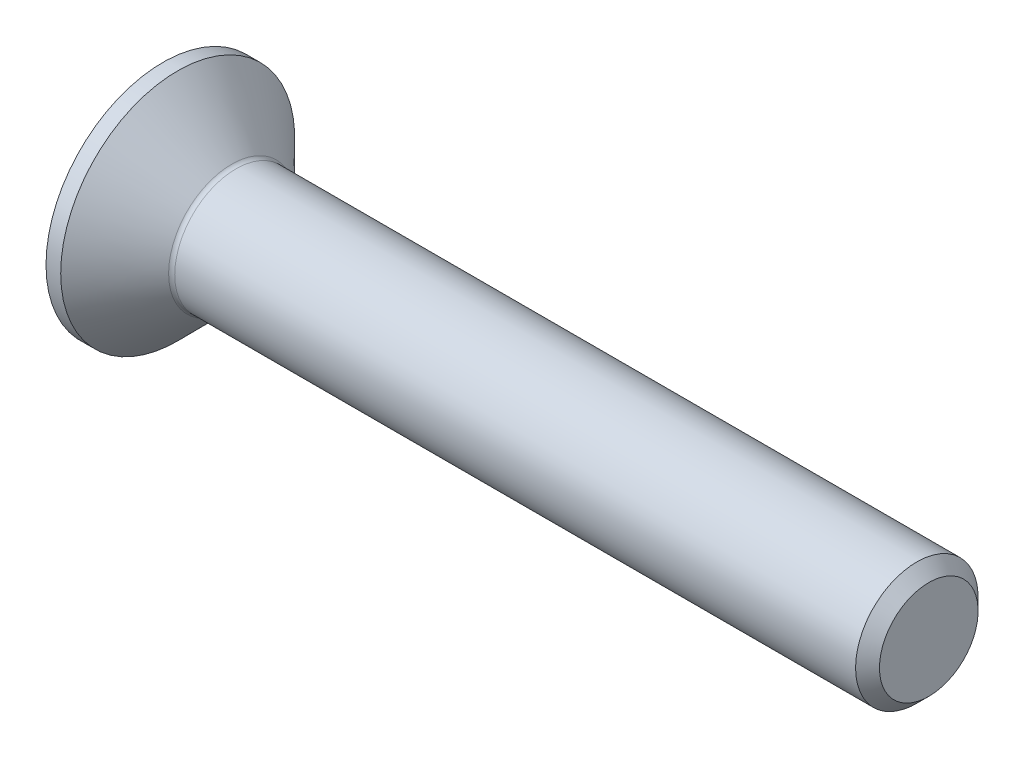
ISO-10303-21;
HEADER;
FILE_DESCRIPTION(('STEP AP214'),'2;1');
FILE_NAME('part.step','',(''),(''),'','','');
FILE_SCHEMA(('AUTOMOTIVE_DESIGN { 1 0 10303 214 1 1 1 1 }'));
ENDSEC;
DATA;
#1=APPLICATION_CONTEXT('core data for automotive mechanical design processes');
#2=APPLICATION_PROTOCOL_DEFINITION('international standard','automotive_design',2000,#1);
#3=PRODUCT_CONTEXT('',#1,'mechanical');
#4=PRODUCT('Part','Part','',(#3));
#5=PRODUCT_RELATED_PRODUCT_CATEGORY('part','',(#4));
#6=PRODUCT_DEFINITION_FORMATION('','',#4);
#7=PRODUCT_DEFINITION_CONTEXT('part definition',#1,'design');
#8=PRODUCT_DEFINITION('design','',#6,#7);
#9=PRODUCT_DEFINITION_SHAPE('','',#8);
#10=(LENGTH_UNIT() NAMED_UNIT(*) SI_UNIT(.MILLI.,.METRE.));
#11=(NAMED_UNIT(*) PLANE_ANGLE_UNIT() SI_UNIT($,.RADIAN.));
#12=(NAMED_UNIT(*) SI_UNIT($,.STERADIAN.) SOLID_ANGLE_UNIT());
#13=UNCERTAINTY_MEASURE_WITH_UNIT(LENGTH_MEASURE(1.E-05),#10,'distance_accuracy_value','');
#14=(GEOMETRIC_REPRESENTATION_CONTEXT(3) GLOBAL_UNCERTAINTY_ASSIGNED_CONTEXT((#13)) GLOBAL_UNIT_ASSIGNED_CONTEXT((#10,
#11,#12)) REPRESENTATION_CONTEXT('',''));
#15=CARTESIAN_POINT('',(0.,0.,0.));
#16=DIRECTION('',(0.,0.,1.));
#17=DIRECTION('',(1.,0.,0.));
#18=AXIS2_PLACEMENT_3D('',#15,#16,#17);
#19=CARTESIAN_POINT('',(0.,0.,0.));
#20=DIRECTION('',(-1.,0.,0.));
#21=DIRECTION('',(0.,0.,1.));
#22=AXIS2_PLACEMENT_3D('',#19,#20,#21);
#23=PLANE('',#22);
#24=CARTESIAN_POINT('',(0.,0.,0.));
#25=DIRECTION('',(-1.,0.,0.));
#26=DIRECTION('',(0.,0.,1.));
#27=AXIS2_PLACEMENT_3D('',#24,#25,#26);
#28=CIRCLE('',#27,3.82);
#29=CARTESIAN_POINT('',(0.,0.,3.82));
#30=VERTEX_POINT('',#29);
#31=EDGE_CURVE('E157',#30,#30,#28,.T.);
#32=ORIENTED_EDGE('',*,*,#31,.T.);
#33=EDGE_LOOP('',(#32));
#34=FACE_BOUND('',#33,.T.);
#35=DIRECTION('',(0.,-0.5,-0.866025403784439));
#36=VECTOR('',#35,1.);
#37=CARTESIAN_POINT('',(0.,-0.727461339178927,1.26));
#38=LINE('',#37,#36);
#39=CARTESIAN_POINT('',(0.,-0.727461339178927,1.26));
#40=VERTEX_POINT('',#39);
#41=CARTESIAN_POINT('',(0.,-1.45492267835786,0.));
#42=VERTEX_POINT('',#41);
#43=EDGE_CURVE('E119',#40,#42,#38,.T.);
#44=ORIENTED_EDGE('',*,*,#43,.T.);
#45=DIRECTION('',(0.,0.5,-0.866025403784439));
#46=VECTOR('',#45,1.);
#47=CARTESIAN_POINT('',(0.,-1.45492267835786,0.));
#48=LINE('',#47,#46);
#49=CARTESIAN_POINT('',(0.,-0.727461339178928,-1.26));
#50=VERTEX_POINT('',#49);
#51=EDGE_CURVE('E49',#42,#50,#48,.T.);
#52=ORIENTED_EDGE('',*,*,#51,.T.);
#53=DIRECTION('',(0.,1.,0.));
#54=VECTOR('',#53,1.);
#55=CARTESIAN_POINT('',(0.,-0.727461339178928,-1.26));
#56=LINE('',#55,#54);
#57=CARTESIAN_POINT('',(0.,0.72746133917893,-1.26));
#58=VERTEX_POINT('',#57);
#59=EDGE_CURVE('E134',#50,#58,#56,.T.);
#60=ORIENTED_EDGE('',*,*,#59,.T.);
#61=DIRECTION('',(0.,0.5,0.866025403784439));
#62=VECTOR('',#61,1.);
#63=CARTESIAN_POINT('',(0.,0.72746133917893,-1.26));
#64=LINE('',#63,#62);
#65=CARTESIAN_POINT('',(0.,1.45492267835786,0.));
#66=VERTEX_POINT('',#65);
#67=EDGE_CURVE('E270',#58,#66,#64,.T.);
#68=ORIENTED_EDGE('',*,*,#67,.T.);
#69=DIRECTION('',(0.,-0.5,0.866025403784439));
#70=VECTOR('',#69,1.);
#71=CARTESIAN_POINT('',(0.,1.45492267835786,0.));
#72=LINE('',#71,#70);
#73=CARTESIAN_POINT('',(0.,0.72746133917893,1.26));
#74=VERTEX_POINT('',#73);
#75=EDGE_CURVE('E273',#66,#74,#72,.T.);
#76=ORIENTED_EDGE('',*,*,#75,.T.);
#77=DIRECTION('',(0.,-1.,0.));
#78=VECTOR('',#77,1.);
#79=CARTESIAN_POINT('',(0.,0.72746133917893,1.26));
#80=LINE('',#79,#78);
#81=EDGE_CURVE('E276',#74,#40,#80,.T.);
#82=ORIENTED_EDGE('',*,*,#81,.T.);
#83=EDGE_LOOP('',(#44,#52,#60,#68,#76,#82));
#84=FACE_BOUND('',#83,.T.);
#85=ADVANCED_FACE('F34',(#34,#84),#23,.T.);
#86=CARTESIAN_POINT('',(0.,0.,0.));
#87=DIRECTION('',(-1.,0.,0.));
#88=DIRECTION('',(0.,0.,1.));
#89=AXIS2_PLACEMENT_3D('',#86,#87,#88);
#90=CYLINDRICAL_SURFACE('',#89,3.82);
#91=CARTESIAN_POINT('',(0.480000000000008,0.,0.));
#92=DIRECTION('',(-1.,0.,0.));
#93=DIRECTION('',(0.,0.,1.));
#94=AXIS2_PLACEMENT_3D('',#91,#92,#93);
#95=CIRCLE('',#94,3.82);
#96=CARTESIAN_POINT('',(0.480000000000008,0.,3.82));
#97=VERTEX_POINT('',#96);
#98=EDGE_CURVE('E154',#97,#97,#95,.T.);
#99=ORIENTED_EDGE('',*,*,#98,.T.);
#100=EDGE_LOOP('',(#99));
#101=FACE_BOUND('',#100,.T.);
#102=ORIENTED_EDGE('',*,*,#31,.F.);
#103=EDGE_LOOP('',(#102));
#104=FACE_BOUND('',#103,.T.);
#105=ADVANCED_FACE('F178',(#101,#104),#90,.T.);
#106=CARTESIAN_POINT('',(0.480000000000008,0.,0.));
#107=DIRECTION('',(-1.,0.,0.));
#108=DIRECTION('',(0.,0.,1.));
#109=AXIS2_PLACEMENT_3D('',#106,#107,#108);
#110=CONICAL_SURFACE('',#109,3.82,0.78539816339745);
#111=CARTESIAN_POINT('',(2.24142135623731,0.,0.));
#112=DIRECTION('',(-1.,0.,0.));
#113=DIRECTION('',(0.,0.,1.));
#114=AXIS2_PLACEMENT_3D('',#111,#112,#113);
#115=CIRCLE('',#114,2.05857864376269);
#116=CARTESIAN_POINT('',(2.24142135623731,0.,2.05857864376269));
#117=VERTEX_POINT('',#116);
#118=EDGE_CURVE('E42',#117,#117,#115,.T.);
#119=ORIENTED_EDGE('',*,*,#118,.T.);
#120=EDGE_LOOP('',(#119));
#121=FACE_BOUND('',#120,.T.);
#122=ORIENTED_EDGE('',*,*,#98,.F.);
#123=EDGE_LOOP('',(#122));
#124=FACE_BOUND('',#123,.T.);
#125=ADVANCED_FACE('F162',(#121,#124),#110,.T.);
#126=CARTESIAN_POINT('',(0.,0.,0.));
#127=DIRECTION('',(-1.,0.,0.));
#128=DIRECTION('',(0.,0.,1.));
#129=AXIS2_PLACEMENT_3D('',#126,#127,#128);
#130=CYLINDRICAL_SURFACE('',#129,2.);
#131=CARTESIAN_POINT('',(2.38284271247462,0.,0.));
#132=DIRECTION('',(-1.,0.,0.));
#133=DIRECTION('',(0.,0.,1.));
#134=AXIS2_PLACEMENT_3D('',#131,#132,#133);
#135=CIRCLE('',#134,2.);
#136=CARTESIAN_POINT('',(2.38284271247462,0.,2.));
#137=VERTEX_POINT('',#136);
#138=EDGE_CURVE('E11',#137,#137,#135,.F.);
#139=ORIENTED_EDGE('',*,*,#138,.T.);
#140=EDGE_LOOP('',(#139));
#141=FACE_BOUND('',#140,.T.);
#142=CARTESIAN_POINT('',(24.61,0.,0.));
#143=DIRECTION('',(-1.,0.,0.));
#144=DIRECTION('',(0.,0.,1.));
#145=AXIS2_PLACEMENT_3D('',#142,#143,#144);
#146=CIRCLE('',#145,2.);
#147=CARTESIAN_POINT('',(24.61,0.,2.));
#148=VERTEX_POINT('',#147);
#149=EDGE_CURVE('E151',#148,#148,#146,.T.);
#150=ORIENTED_EDGE('',*,*,#149,.T.);
#151=EDGE_LOOP('',(#150));
#152=FACE_BOUND('',#151,.T.);
#153=ADVANCED_FACE('F189',(#141,#152),#130,.T.);
#154=CARTESIAN_POINT('',(25.,0.,0.));
#155=DIRECTION('',(-1.,0.,0.));
#156=DIRECTION('',(0.,0.,1.));
#157=AXIS2_PLACEMENT_3D('',#154,#155,#156);
#158=CONICAL_SURFACE('',#157,1.61,0.78539816339747);
#159=ORIENTED_EDGE('',*,*,#149,.F.);
#160=EDGE_LOOP('',(#159));
#161=FACE_BOUND('',#160,.T.);
#162=CARTESIAN_POINT('',(25.,0.,0.));
#163=DIRECTION('',(-1.,0.,0.));
#164=DIRECTION('',(0.,0.,1.));
#165=AXIS2_PLACEMENT_3D('',#162,#163,#164);
#166=CIRCLE('',#165,1.61);
#167=CARTESIAN_POINT('',(25.,0.,1.61));
#168=VERTEX_POINT('',#167);
#169=EDGE_CURVE('E147',#168,#168,#166,.T.);
#170=ORIENTED_EDGE('',*,*,#169,.T.);
#171=EDGE_LOOP('',(#170));
#172=FACE_BOUND('',#171,.T.);
#173=ADVANCED_FACE('F173',(#161,#172),#158,.T.);
#174=CARTESIAN_POINT('',(25.,1.61,0.));
#175=DIRECTION('',(1.,0.,0.));
#176=DIRECTION('',(0.,0.,-1.));
#177=AXIS2_PLACEMENT_3D('',#174,#175,#176);
#178=PLANE('',#177);
#179=ORIENTED_EDGE('',*,*,#169,.F.);
#180=EDGE_LOOP('',(#179));
#181=FACE_BOUND('',#180,.T.);
#182=ADVANCED_FACE('F166',(#181),#178,.T.);
#183=CARTESIAN_POINT('',(2.38284271247462,0.,0.));
#184=DIRECTION('',(-1.,0.,0.));
#185=DIRECTION('',(0.,0.,1.));
#186=AXIS2_PLACEMENT_3D('',#183,#184,#185);
#187=TOROIDAL_SURFACE('',#186,2.2,0.2);
#188=ORIENTED_EDGE('',*,*,#138,.F.);
#189=EDGE_LOOP('',(#188));
#190=FACE_BOUND('',#189,.T.);
#191=ORIENTED_EDGE('',*,*,#118,.F.);
#192=EDGE_LOOP('',(#191));
#193=FACE_BOUND('',#192,.T.);
#194=ADVANCED_FACE('F36',(#190,#193),#187,.F.);
#195=CARTESIAN_POINT('',(1.8,-1.45492267835786,0.));
#196=DIRECTION('',(0.,0.866025403784439,0.5));
#197=DIRECTION('',(0.,-0.5,0.866025403784439));
#198=AXIS2_PLACEMENT_3D('',#195,#196,#197);
#199=PLANE('',#198);
#200=ORIENTED_EDGE('',*,*,#51,.F.);
#201=DIRECTION('',(-1.,0.,0.));
#202=VECTOR('',#201,1.);
#203=CARTESIAN_POINT('',(1.8,-1.45492267835786,0.));
#204=LINE('',#203,#202);
#205=CARTESIAN_POINT('',(1.8,-1.45492267835786,0.));
#206=VERTEX_POINT('',#205);
#207=EDGE_CURVE('E267',#206,#42,#204,.T.);
#208=ORIENTED_EDGE('',*,*,#207,.F.);
#209=DIRECTION('',(0.,0.5,-0.866025403784439));
#210=VECTOR('',#209,1.);
#211=CARTESIAN_POINT('',(1.8,-1.45492267835786,0.));
#212=LINE('',#211,#210);
#213=CARTESIAN_POINT('',(1.8,-1.09119200876839,-0.63));
#214=VERTEX_POINT('',#213);
#215=EDGE_CURVE('E116',#206,#214,#212,.T.);
#216=ORIENTED_EDGE('',*,*,#215,.T.);
#217=CARTESIAN_POINT('',(1.8,-0.727461339178928,-1.26));
#218=VERTEX_POINT('',#217);
#219=EDGE_CURVE('E110',#214,#218,#212,.T.);
#220=ORIENTED_EDGE('',*,*,#219,.T.);
#221=DIRECTION('',(-1.,0.,0.));
#222=VECTOR('',#221,1.);
#223=CARTESIAN_POINT('',(1.8,-0.727461339178928,-1.26));
#224=LINE('',#223,#222);
#225=EDGE_CURVE('E114',#218,#50,#224,.T.);
#226=ORIENTED_EDGE('',*,*,#225,.T.);
#227=EDGE_LOOP('',(#200,#208,#216,#220,#226));
#228=FACE_BOUND('',#227,.T.);
#229=ADVANCED_FACE('F112',(#228),#199,.T.);
#230=CARTESIAN_POINT('',(1.8,-0.727461339178928,-1.26));
#231=DIRECTION('',(0.,0.,1.));
#232=DIRECTION('',(0.,-1.,0.));
#233=AXIS2_PLACEMENT_3D('',#230,#231,#232);
#234=PLANE('',#233);
#235=ORIENTED_EDGE('',*,*,#59,.F.);
#236=ORIENTED_EDGE('',*,*,#225,.F.);
#237=DIRECTION('',(0.,1.,0.));
#238=VECTOR('',#237,1.);
#239=CARTESIAN_POINT('',(1.8,-0.727461339178928,-1.26));
#240=LINE('',#239,#238);
#241=CARTESIAN_POINT('',(1.8,0.,-1.26));
#242=VERTEX_POINT('',#241);
#243=EDGE_CURVE('E122',#218,#242,#240,.T.);
#244=ORIENTED_EDGE('',*,*,#243,.T.);
#245=CARTESIAN_POINT('',(1.8,0.72746133917893,-1.26));
#246=VERTEX_POINT('',#245);
#247=EDGE_CURVE('E129',#242,#246,#240,.T.);
#248=ORIENTED_EDGE('',*,*,#247,.T.);
#249=DIRECTION('',(-1.,0.,0.));
#250=VECTOR('',#249,1.);
#251=CARTESIAN_POINT('',(1.8,0.72746133917893,-1.26));
#252=LINE('',#251,#250);
#253=EDGE_CURVE('E136',#246,#58,#252,.T.);
#254=ORIENTED_EDGE('',*,*,#253,.T.);
#255=EDGE_LOOP('',(#235,#236,#244,#248,#254));
#256=FACE_BOUND('',#255,.T.);
#257=ADVANCED_FACE('F131',(#256),#234,.T.);
#258=CARTESIAN_POINT('',(1.8,0.72746133917893,-1.26));
#259=DIRECTION('',(0.,-0.866025403784439,0.5));
#260=DIRECTION('',(0.,-0.5,-0.866025403784439));
#261=AXIS2_PLACEMENT_3D('',#258,#259,#260);
#262=PLANE('',#261);
#263=ORIENTED_EDGE('',*,*,#67,.F.);
#264=ORIENTED_EDGE('',*,*,#253,.F.);
#265=DIRECTION('',(0.,0.5,0.866025403784439));
#266=VECTOR('',#265,1.);
#267=CARTESIAN_POINT('',(1.8,0.72746133917893,-1.26));
#268=LINE('',#267,#266);
#269=CARTESIAN_POINT('',(1.8,1.09119200876839,-0.630000000000001));
#270=VERTEX_POINT('',#269);
#271=EDGE_CURVE('E259',#246,#270,#268,.T.);
#272=ORIENTED_EDGE('',*,*,#271,.T.);
#273=CARTESIAN_POINT('',(1.8,1.45492267835786,0.));
#274=VERTEX_POINT('',#273);
#275=EDGE_CURVE('E128',#270,#274,#268,.T.);
#276=ORIENTED_EDGE('',*,*,#275,.T.);
#277=DIRECTION('',(-1.,0.,0.));
#278=VECTOR('',#277,1.);
#279=CARTESIAN_POINT('',(1.8,1.45492267835786,0.));
#280=LINE('',#279,#278);
#281=EDGE_CURVE('E142',#274,#66,#280,.T.);
#282=ORIENTED_EDGE('',*,*,#281,.T.);
#283=EDGE_LOOP('',(#263,#264,#272,#276,#282));
#284=FACE_BOUND('',#283,.T.);
#285=ADVANCED_FACE('F203',(#284),#262,.T.);
#286=CARTESIAN_POINT('',(1.8,1.45492267835786,0.));
#287=DIRECTION('',(0.,-0.866025403784438,-0.5));
#288=DIRECTION('',(0.,0.5,-0.866025403784439));
#289=AXIS2_PLACEMENT_3D('',#286,#287,#288);
#290=PLANE('',#289);
#291=ORIENTED_EDGE('',*,*,#75,.F.);
#292=ORIENTED_EDGE('',*,*,#281,.F.);
#293=DIRECTION('',(0.,-0.5,0.866025403784439));
#294=VECTOR('',#293,1.);
#295=CARTESIAN_POINT('',(1.8,1.45492267835786,0.));
#296=LINE('',#295,#294);
#297=CARTESIAN_POINT('',(1.8,1.09119200876839,0.63));
#298=VERTEX_POINT('',#297);
#299=EDGE_CURVE('E57',#274,#298,#296,.T.);
#300=ORIENTED_EDGE('',*,*,#299,.T.);
#301=CARTESIAN_POINT('',(1.8,0.72746133917893,1.26));
#302=VERTEX_POINT('',#301);
#303=EDGE_CURVE('E238',#298,#302,#296,.T.);
#304=ORIENTED_EDGE('',*,*,#303,.T.);
#305=DIRECTION('',(-1.,0.,0.));
#306=VECTOR('',#305,1.);
#307=CARTESIAN_POINT('',(1.8,0.72746133917893,1.26));
#308=LINE('',#307,#306);
#309=EDGE_CURVE('E252',#302,#74,#308,.T.);
#310=ORIENTED_EDGE('',*,*,#309,.T.);
#311=EDGE_LOOP('',(#291,#292,#300,#304,#310));
#312=FACE_BOUND('',#311,.T.);
#313=ADVANCED_FACE('F206',(#312),#290,.T.);
#314=CARTESIAN_POINT('',(1.8,0.72746133917893,1.26));
#315=DIRECTION('',(0.,0.,-1.));
#316=DIRECTION('',(-1.,0.,0.));
#317=AXIS2_PLACEMENT_3D('',#314,#315,#316);
#318=PLANE('',#317);
#319=ORIENTED_EDGE('',*,*,#81,.F.);
#320=ORIENTED_EDGE('',*,*,#309,.F.);
#321=DIRECTION('',(0.,-1.,0.));
#322=VECTOR('',#321,1.);
#323=CARTESIAN_POINT('',(1.8,0.72746133917893,1.26));
#324=LINE('',#323,#322);
#325=CARTESIAN_POINT('',(1.8,0.,1.26));
#326=VERTEX_POINT('',#325);
#327=EDGE_CURVE('E237',#302,#326,#324,.T.);
#328=ORIENTED_EDGE('',*,*,#327,.T.);
#329=CARTESIAN_POINT('',(1.8,-0.727461339178927,1.26));
#330=VERTEX_POINT('',#329);
#331=EDGE_CURVE('E243',#326,#330,#324,.T.);
#332=ORIENTED_EDGE('',*,*,#331,.T.);
#333=DIRECTION('',(-1.,0.,0.));
#334=VECTOR('',#333,1.);
#335=CARTESIAN_POINT('',(1.8,-0.727461339178927,1.26));
#336=LINE('',#335,#334);
#337=EDGE_CURVE('E282',#330,#40,#336,.T.);
#338=ORIENTED_EDGE('',*,*,#337,.T.);
#339=EDGE_LOOP('',(#319,#320,#328,#332,#338));
#340=FACE_BOUND('',#339,.T.);
#341=ADVANCED_FACE('F210',(#340),#318,.T.);
#342=CARTESIAN_POINT('',(1.8,-0.727461339178927,1.26));
#343=DIRECTION('',(0.,0.866025403784438,-0.5));
#344=DIRECTION('',(0.,0.5,0.866025403784439));
#345=AXIS2_PLACEMENT_3D('',#342,#343,#344);
#346=PLANE('',#345);
#347=ORIENTED_EDGE('',*,*,#43,.F.);
#348=ORIENTED_EDGE('',*,*,#337,.F.);
#349=DIRECTION('',(0.,-0.5,-0.866025403784439));
#350=VECTOR('',#349,1.);
#351=CARTESIAN_POINT('',(1.8,-0.727461339178927,1.26));
#352=LINE('',#351,#350);
#353=CARTESIAN_POINT('',(1.8,-1.09119200876839,0.629999999999999));
#354=VERTEX_POINT('',#353);
#355=EDGE_CURVE('E246',#330,#354,#352,.T.);
#356=ORIENTED_EDGE('',*,*,#355,.T.);
#357=EDGE_CURVE('E253',#354,#206,#352,.T.);
#358=ORIENTED_EDGE('',*,*,#357,.T.);
#359=ORIENTED_EDGE('',*,*,#207,.T.);
#360=EDGE_LOOP('',(#347,#348,#356,#358,#359));
#361=FACE_BOUND('',#360,.T.);
#362=ADVANCED_FACE('F213',(#361),#346,.T.);
#363=CARTESIAN_POINT('',(1.8,-2.18238401753678,1.26));
#364=DIRECTION('',(-1.,0.,0.));
#365=DIRECTION('',(0.,0.,1.));
#366=AXIS2_PLACEMENT_3D('',#363,#364,#365);
#367=PLANE('',#366);
#368=CARTESIAN_POINT('',(1.8,0.,0.));
#369=DIRECTION('',(-1.,0.,0.));
#370=DIRECTION('',(0.,0.,1.));
#371=AXIS2_PLACEMENT_3D('',#368,#369,#370);
#372=CIRCLE('',#371,1.26);
#373=EDGE_CURVE('E135',#354,#326,#372,.T.);
#374=ORIENTED_EDGE('',*,*,#373,.F.);
#375=ORIENTED_EDGE('',*,*,#355,.F.);
#376=ORIENTED_EDGE('',*,*,#331,.F.);
#377=EDGE_LOOP('',(#374,#375,#376));
#378=FACE_BOUND('',#377,.T.);
#379=ADVANCED_FACE('F217',(#378),#367,.T.);
#380=EDGE_CURVE('E139',#214,#354,#372,.T.);
#381=ORIENTED_EDGE('',*,*,#380,.F.);
#382=ORIENTED_EDGE('',*,*,#215,.F.);
#383=ORIENTED_EDGE('',*,*,#357,.F.);
#384=EDGE_LOOP('',(#381,#382,#383));
#385=FACE_BOUND('',#384,.T.);
#386=ADVANCED_FACE('F220',(#385),#367,.T.);
#387=EDGE_CURVE('E124',#242,#214,#372,.T.);
#388=ORIENTED_EDGE('',*,*,#387,.F.);
#389=ORIENTED_EDGE('',*,*,#243,.F.);
#390=ORIENTED_EDGE('',*,*,#219,.F.);
#391=EDGE_LOOP('',(#388,#389,#390));
#392=FACE_BOUND('',#391,.T.);
#393=ADVANCED_FACE('F123',(#392),#367,.T.);
#394=EDGE_CURVE('E255',#270,#242,#372,.T.);
#395=ORIENTED_EDGE('',*,*,#394,.F.);
#396=ORIENTED_EDGE('',*,*,#271,.F.);
#397=ORIENTED_EDGE('',*,*,#247,.F.);
#398=EDGE_LOOP('',(#395,#396,#397));
#399=FACE_BOUND('',#398,.T.);
#400=ADVANCED_FACE('F232',(#399),#367,.T.);
#401=EDGE_CURVE('E148',#298,#270,#372,.T.);
#402=ORIENTED_EDGE('',*,*,#401,.F.);
#403=ORIENTED_EDGE('',*,*,#299,.F.);
#404=ORIENTED_EDGE('',*,*,#275,.F.);
#405=EDGE_LOOP('',(#402,#403,#404));
#406=FACE_BOUND('',#405,.T.);
#407=ADVANCED_FACE('F227',(#406),#367,.T.);
#408=EDGE_CURVE('E141',#326,#298,#372,.T.);
#409=ORIENTED_EDGE('',*,*,#408,.F.);
#410=ORIENTED_EDGE('',*,*,#327,.F.);
#411=ORIENTED_EDGE('',*,*,#303,.F.);
#412=EDGE_LOOP('',(#409,#410,#411));
#413=FACE_BOUND('',#412,.T.);
#414=ADVANCED_FACE('F198',(#413),#367,.T.);
#415=CARTESIAN_POINT('',(1.8,0.,0.));
#416=DIRECTION('',(-1.,0.,0.));
#417=DIRECTION('',(0.,0.,1.));
#418=AXIS2_PLACEMENT_3D('',#415,#416,#417);
#419=CONICAL_SURFACE('',#418,1.26,1.04719755119659);
#420=CARTESIAN_POINT('',(2.52746133917894,0.,0.));
#421=VERTEX_POINT('',#420);
#422=VERTEX_LOOP('',#421);
#423=FACE_BOUND('',#422,.T.);
#424=ORIENTED_EDGE('',*,*,#408,.T.);
#425=ORIENTED_EDGE('',*,*,#401,.T.);
#426=ORIENTED_EDGE('',*,*,#394,.T.);
#427=ORIENTED_EDGE('',*,*,#387,.T.);
#428=ORIENTED_EDGE('',*,*,#380,.T.);
#429=ORIENTED_EDGE('',*,*,#373,.T.);
#430=EDGE_LOOP('',(#424,#425,#426,#427,#428,#429));
#431=FACE_BOUND('',#430,.T.);
#432=ADVANCED_FACE('F196',(#423,#431),#419,.F.);
#433=CLOSED_SHELL('',(#85,#105,#125,#153,#173,#182,#194,#229,#257,#285,#313,#341,#362,#379,#386,
#393,#400,#407,#414,#432));
#434=MANIFOLD_SOLID_BREP('B2',#433);
#435=ADVANCED_BREP_SHAPE_REPRESENTATION('',(#18,#434),#14);
#436=SHAPE_DEFINITION_REPRESENTATION(#9,#435);
ENDSEC;
END-ISO-10303-21;
